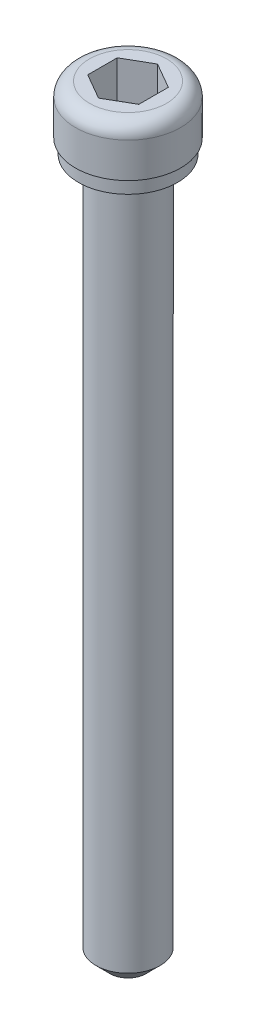
ISO-10303-21;
HEADER;
FILE_DESCRIPTION(('STEP AP214'),'2;1');
FILE_NAME('part.step','',(''),(''),'','','');
FILE_SCHEMA(('AUTOMOTIVE_DESIGN { 1 0 10303 214 1 1 1 1 }'));
ENDSEC;
DATA;
#1=APPLICATION_CONTEXT('core data for automotive mechanical design processes');
#2=APPLICATION_PROTOCOL_DEFINITION('international standard','automotive_design',2000,#1);
#3=PRODUCT_CONTEXT('',#1,'mechanical');
#4=PRODUCT('Part','Part','',(#3));
#5=PRODUCT_RELATED_PRODUCT_CATEGORY('part','',(#4));
#6=PRODUCT_DEFINITION_FORMATION('','',#4);
#7=PRODUCT_DEFINITION_CONTEXT('part definition',#1,'design');
#8=PRODUCT_DEFINITION('design','',#6,#7);
#9=PRODUCT_DEFINITION_SHAPE('','',#8);
#10=(LENGTH_UNIT() NAMED_UNIT(*) SI_UNIT(.MILLI.,.METRE.));
#11=(NAMED_UNIT(*) PLANE_ANGLE_UNIT() SI_UNIT($,.RADIAN.));
#12=(NAMED_UNIT(*) SI_UNIT($,.STERADIAN.) SOLID_ANGLE_UNIT());
#13=UNCERTAINTY_MEASURE_WITH_UNIT(LENGTH_MEASURE(1.E-05),#10,'distance_accuracy_value','');
#14=(GEOMETRIC_REPRESENTATION_CONTEXT(3) GLOBAL_UNCERTAINTY_ASSIGNED_CONTEXT((#13)) GLOBAL_UNIT_ASSIGNED_CONTEXT((#10,
#11,#12)) REPRESENTATION_CONTEXT('',''));
#15=CARTESIAN_POINT('',(0.,0.,0.));
#16=DIRECTION('',(0.,0.,1.));
#17=DIRECTION('',(1.,0.,0.));
#18=AXIS2_PLACEMENT_3D('',#15,#16,#17);
#19=CARTESIAN_POINT('',(-1.3890625,39.497,0.801975608296219));
#20=DIRECTION('',(-0.5,0.,0.866025403784439));
#21=DIRECTION('',(0.866025403784439,0.,0.5));
#22=AXIS2_PLACEMENT_3D('',#19,#20,#21);
#23=PLANE('',#22);
#24=DIRECTION('',(0.866025403784439,0.,0.5));
#25=VECTOR('',#24,1.);
#26=CARTESIAN_POINT('',(-1.3890625,39.497,0.801975608296219));
#27=LINE('',#26,#25);
#28=CARTESIAN_POINT('',(-1.3890625,39.497,0.801975608296219));
#29=VERTEX_POINT('',#28);
#30=CARTESIAN_POINT('',(0.,39.497,1.60395121659243));
#31=VERTEX_POINT('',#30);
#32=EDGE_CURVE('E69',#29,#31,#27,.T.);
#33=ORIENTED_EDGE('',*,*,#32,.F.);
#34=DIRECTION('',(0.,1.,0.));
#35=VECTOR('',#34,1.);
#36=CARTESIAN_POINT('',(-1.3890625,39.497,0.801975608296219));
#37=LINE('',#36,#35);
#38=CARTESIAN_POINT('',(-1.3890625,41.529,0.801975608296219));
#39=VERTEX_POINT('',#38);
#40=EDGE_CURVE('E92',#29,#39,#37,.T.);
#41=ORIENTED_EDGE('',*,*,#40,.T.);
#42=DIRECTION('',(0.866025403784439,0.,0.5));
#43=VECTOR('',#42,1.);
#44=CARTESIAN_POINT('',(-1.3890625,41.529,0.801975608296219));
#45=LINE('',#44,#43);
#46=CARTESIAN_POINT('',(0.,41.529,1.60395121659243));
#47=VERTEX_POINT('',#46);
#48=EDGE_CURVE('E78',#47,#39,#45,.F.);
#49=ORIENTED_EDGE('',*,*,#48,.F.);
#50=DIRECTION('',(0.,1.,0.));
#51=VECTOR('',#50,1.);
#52=CARTESIAN_POINT('',(0.,39.497,1.60395121659243));
#53=LINE('',#52,#51);
#54=EDGE_CURVE('E87',#47,#31,#53,.F.);
#55=ORIENTED_EDGE('',*,*,#54,.T.);
#56=EDGE_LOOP('',(#33,#41,#49,#55));
#57=FACE_BOUND('',#56,.T.);
#58=ADVANCED_FACE('F15',(#57),#23,.F.);
#59=CARTESIAN_POINT('',(0.,39.497,1.60395121659243));
#60=DIRECTION('',(0.5,0.,0.866025403784439));
#61=DIRECTION('',(0.866025403784439,0.,-0.5));
#62=AXIS2_PLACEMENT_3D('',#59,#60,#61);
#63=PLANE('',#62);
#64=DIRECTION('',(0.866025403784439,0.,-0.5));
#65=VECTOR('',#64,1.);
#66=CARTESIAN_POINT('',(0.,39.497,1.60395121659243));
#67=LINE('',#66,#65);
#68=CARTESIAN_POINT('',(1.3890625,39.497,0.80197560829622));
#69=VERTEX_POINT('',#68);
#70=EDGE_CURVE('E96',#31,#69,#67,.T.);
#71=ORIENTED_EDGE('',*,*,#70,.F.);
#72=ORIENTED_EDGE('',*,*,#54,.F.);
#73=DIRECTION('',(0.866025403784439,0.,-0.5));
#74=VECTOR('',#73,1.);
#75=CARTESIAN_POINT('',(0.,41.529,1.60395121659243));
#76=LINE('',#75,#74);
#77=CARTESIAN_POINT('',(1.3890625,41.529,0.80197560829622));
#78=VERTEX_POINT('',#77);
#79=EDGE_CURVE('E74',#78,#47,#76,.F.);
#80=ORIENTED_EDGE('',*,*,#79,.F.);
#81=DIRECTION('',(0.,1.,0.));
#82=VECTOR('',#81,1.);
#83=CARTESIAN_POINT('',(1.3890625,39.497,0.801975608296219));
#84=LINE('',#83,#82);
#85=EDGE_CURVE('E183',#78,#69,#84,.F.);
#86=ORIENTED_EDGE('',*,*,#85,.T.);
#87=EDGE_LOOP('',(#71,#72,#80,#86));
#88=FACE_BOUND('',#87,.T.);
#89=ADVANCED_FACE('F95',(#88),#63,.F.);
#90=CARTESIAN_POINT('',(-1.3890625,39.497,-0.801975608296215));
#91=DIRECTION('',(-1.,0.,0.));
#92=DIRECTION('',(0.,0.,1.));
#93=AXIS2_PLACEMENT_3D('',#90,#91,#92);
#94=PLANE('',#93);
#95=DIRECTION('',(0.,0.,1.));
#96=VECTOR('',#95,1.);
#97=CARTESIAN_POINT('',(-1.3890625,39.497,0.));
#98=LINE('',#97,#96);
#99=CARTESIAN_POINT('',(-1.3890625,39.497,-0.801975608296214));
#100=VERTEX_POINT('',#99);
#101=EDGE_CURVE('E181',#100,#29,#98,.T.);
#102=ORIENTED_EDGE('',*,*,#101,.F.);
#103=DIRECTION('',(0.,1.,0.));
#104=VECTOR('',#103,1.);
#105=CARTESIAN_POINT('',(-1.3890625,39.497,-0.801975608296213));
#106=LINE('',#105,#104);
#107=CARTESIAN_POINT('',(-1.3890625,41.529,-0.801975608296214));
#108=VERTEX_POINT('',#107);
#109=EDGE_CURVE('E169',#100,#108,#106,.T.);
#110=ORIENTED_EDGE('',*,*,#109,.T.);
#111=DIRECTION('',(0.,0.,1.));
#112=VECTOR('',#111,1.);
#113=CARTESIAN_POINT('',(-1.3890625,41.529,-0.801975608296215));
#114=LINE('',#113,#112);
#115=EDGE_CURVE('E98',#39,#108,#114,.F.);
#116=ORIENTED_EDGE('',*,*,#115,.F.);
#117=ORIENTED_EDGE('',*,*,#40,.F.);
#118=EDGE_LOOP('',(#102,#110,#116,#117));
#119=FACE_BOUND('',#118,.T.);
#120=ADVANCED_FACE('F189',(#119),#94,.F.);
#121=CARTESIAN_POINT('',(1.3890625,39.497,0.801975608296219));
#122=DIRECTION('',(1.,0.,0.));
#123=DIRECTION('',(0.,0.,-1.));
#124=AXIS2_PLACEMENT_3D('',#121,#122,#123);
#125=PLANE('',#124);
#126=DIRECTION('',(0.,0.,1.));
#127=VECTOR('',#126,1.);
#128=CARTESIAN_POINT('',(1.3890625,39.497,0.));
#129=LINE('',#128,#127);
#130=CARTESIAN_POINT('',(1.3890625,39.497,-0.801975608296213));
#131=VERTEX_POINT('',#130);
#132=EDGE_CURVE('E178',#69,#131,#129,.F.);
#133=ORIENTED_EDGE('',*,*,#132,.F.);
#134=ORIENTED_EDGE('',*,*,#85,.F.);
#135=DIRECTION('',(0.,0.,-1.));
#136=VECTOR('',#135,1.);
#137=CARTESIAN_POINT('',(1.3890625,41.529,0.801975608296219));
#138=LINE('',#137,#136);
#139=CARTESIAN_POINT('',(1.3890625,41.529,-0.801975608296212));
#140=VERTEX_POINT('',#139);
#141=EDGE_CURVE('E82',#140,#78,#138,.F.);
#142=ORIENTED_EDGE('',*,*,#141,.F.);
#143=DIRECTION('',(0.,1.,0.));
#144=VECTOR('',#143,1.);
#145=CARTESIAN_POINT('',(1.3890625,39.497,-0.801975608296212));
#146=LINE('',#145,#144);
#147=EDGE_CURVE('E167',#140,#131,#146,.F.);
#148=ORIENTED_EDGE('',*,*,#147,.T.);
#149=EDGE_LOOP('',(#133,#134,#142,#148));
#150=FACE_BOUND('',#149,.T.);
#151=ADVANCED_FACE('F200',(#150),#125,.F.);
#152=CARTESIAN_POINT('',(0.,39.497,0.));
#153=DIRECTION('',(0.,1.,0.));
#154=DIRECTION('',(0.,0.,1.));
#155=AXIS2_PLACEMENT_3D('',#152,#153,#154);
#156=PLANE('',#155);
#157=ORIENTED_EDGE('',*,*,#132,.T.);
#158=DIRECTION('',(-0.866025403784439,0.,-0.5));
#159=VECTOR('',#158,1.);
#160=CARTESIAN_POINT('',(1.3890625,39.497,-0.801975608296212));
#161=LINE('',#160,#159);
#162=CARTESIAN_POINT('',(0.,39.497,-1.60395121659243));
#163=VERTEX_POINT('',#162);
#164=EDGE_CURVE('E165',#131,#163,#161,.T.);
#165=ORIENTED_EDGE('',*,*,#164,.T.);
#166=DIRECTION('',(-0.866025403784439,0.,0.5));
#167=VECTOR('',#166,1.);
#168=CARTESIAN_POINT('',(0.,39.497,-1.60395121659243));
#169=LINE('',#168,#167);
#170=EDGE_CURVE('E172',#163,#100,#169,.T.);
#171=ORIENTED_EDGE('',*,*,#170,.T.);
#172=ORIENTED_EDGE('',*,*,#101,.T.);
#173=ORIENTED_EDGE('',*,*,#32,.T.);
#174=ORIENTED_EDGE('',*,*,#70,.T.);
#175=EDGE_LOOP('',(#157,#165,#171,#172,#173,#174));
#176=FACE_BOUND('',#175,.T.);
#177=ADVANCED_FACE('F201',(#176),#156,.T.);
#178=CARTESIAN_POINT('',(0.,39.497,-1.60395121659243));
#179=DIRECTION('',(-0.5,0.,-0.866025403784439));
#180=DIRECTION('',(-0.866025403784439,0.,0.5));
#181=AXIS2_PLACEMENT_3D('',#178,#179,#180);
#182=PLANE('',#181);
#183=ORIENTED_EDGE('',*,*,#170,.F.);
#184=DIRECTION('',(0.,1.,0.));
#185=VECTOR('',#184,1.);
#186=CARTESIAN_POINT('',(0.,39.497,-1.60395121659243));
#187=LINE('',#186,#185);
#188=CARTESIAN_POINT('',(0.,41.529,-1.60395121659243));
#189=VERTEX_POINT('',#188);
#190=EDGE_CURVE('E162',#163,#189,#187,.T.);
#191=ORIENTED_EDGE('',*,*,#190,.T.);
#192=DIRECTION('',(-0.866025403784439,0.,0.5));
#193=VECTOR('',#192,1.);
#194=CARTESIAN_POINT('',(0.,41.529,-1.60395121659243));
#195=LINE('',#194,#193);
#196=EDGE_CURVE('E175',#108,#189,#195,.F.);
#197=ORIENTED_EDGE('',*,*,#196,.F.);
#198=ORIENTED_EDGE('',*,*,#109,.F.);
#199=EDGE_LOOP('',(#183,#191,#197,#198));
#200=FACE_BOUND('',#199,.T.);
#201=ADVANCED_FACE('F192',(#200),#182,.F.);
#202=CARTESIAN_POINT('',(1.3890625,39.497,-0.801975608296212));
#203=DIRECTION('',(0.5,0.,-0.866025403784439));
#204=DIRECTION('',(-0.866025403784439,0.,-0.5));
#205=AXIS2_PLACEMENT_3D('',#202,#203,#204);
#206=PLANE('',#205);
#207=ORIENTED_EDGE('',*,*,#164,.F.);
#208=ORIENTED_EDGE('',*,*,#147,.F.);
#209=DIRECTION('',(-0.866025403784439,0.,-0.5));
#210=VECTOR('',#209,1.);
#211=CARTESIAN_POINT('',(1.3890625,41.529,-0.801975608296214));
#212=LINE('',#211,#210);
#213=EDGE_CURVE('E154',#140,#189,#212,.T.);
#214=ORIENTED_EDGE('',*,*,#213,.T.);
#215=ORIENTED_EDGE('',*,*,#190,.F.);
#216=EDGE_LOOP('',(#207,#208,#214,#215));
#217=FACE_BOUND('',#216,.T.);
#218=ADVANCED_FACE('F197',(#217),#206,.F.);
#219=CARTESIAN_POINT('',(-2.0955,41.529,0.));
#220=DIRECTION('',(0.,-1.,0.));
#221=DIRECTION('',(0.,0.,-1.));
#222=AXIS2_PLACEMENT_3D('',#219,#220,#221);
#223=PLANE('',#222);
#224=ORIENTED_EDGE('',*,*,#141,.T.);
#225=ORIENTED_EDGE('',*,*,#79,.T.);
#226=ORIENTED_EDGE('',*,*,#48,.T.);
#227=ORIENTED_EDGE('',*,*,#115,.T.);
#228=ORIENTED_EDGE('',*,*,#196,.T.);
#229=ORIENTED_EDGE('',*,*,#213,.F.);
#230=EDGE_LOOP('',(#224,#225,#226,#227,#228,#229));
#231=FACE_BOUND('',#230,.T.);
#232=CARTESIAN_POINT('',(0.,41.529,0.));
#233=DIRECTION('',(0.,-1.,0.));
#234=DIRECTION('',(0.,0.,1.));
#235=AXIS2_PLACEMENT_3D('',#232,#233,#234);
#236=CIRCLE('',#235,2.0955);
#237=CARTESIAN_POINT('',(0.,41.529,2.0955));
#238=VERTEX_POINT('',#237);
#239=CARTESIAN_POINT('',(0.,41.529,-2.0955));
#240=VERTEX_POINT('',#239);
#241=EDGE_CURVE('E119',#238,#240,#236,.T.);
#242=ORIENTED_EDGE('',*,*,#241,.F.);
#243=CARTESIAN_POINT('',(0.,41.529,0.));
#244=DIRECTION('',(0.,-1.,0.));
#245=DIRECTION('',(0.,0.,-1.));
#246=AXIS2_PLACEMENT_3D('',#243,#244,#245);
#247=CIRCLE('',#246,2.0955);
#248=EDGE_CURVE('E34',#240,#238,#247,.T.);
#249=ORIENTED_EDGE('',*,*,#248,.F.);
#250=EDGE_LOOP('',(#242,#249));
#251=FACE_BOUND('',#250,.T.);
#252=ADVANCED_FACE('F76',(#231,#251),#223,.F.);
#253=CARTESIAN_POINT('',(0.,40.767,0.));
#254=DIRECTION('',(0.,-1.,0.));
#255=DIRECTION('',(0.,0.,-1.));
#256=AXIS2_PLACEMENT_3D('',#253,#254,#255);
#257=TOROIDAL_SURFACE('',#256,2.0955,0.761999999999999);
#258=ORIENTED_EDGE('',*,*,#248,.T.);
#259=ORIENTED_EDGE('',*,*,#241,.T.);
#260=EDGE_LOOP('',(#258,#259));
#261=FACE_BOUND('',#260,.T.);
#262=CARTESIAN_POINT('',(0.,40.767,0.));
#263=DIRECTION('',(0.,-1.,0.));
#264=DIRECTION('',(0.,0.,-1.));
#265=AXIS2_PLACEMENT_3D('',#262,#263,#264);
#266=CIRCLE('',#265,2.8575);
#267=CARTESIAN_POINT('',(0.,40.767,-2.8575));
#268=VERTEX_POINT('',#267);
#269=EDGE_CURVE('E117',#268,#268,#266,.T.);
#270=ORIENTED_EDGE('',*,*,#269,.F.);
#271=EDGE_LOOP('',(#270));
#272=FACE_BOUND('',#271,.T.);
#273=ADVANCED_FACE('F122',(#261,#272),#257,.T.);
#274=CARTESIAN_POINT('',(0.,0.,0.));
#275=DIRECTION('',(0.,-1.,0.));
#276=DIRECTION('',(0.,0.,-1.));
#277=AXIS2_PLACEMENT_3D('',#274,#275,#276);
#278=CYLINDRICAL_SURFACE('',#277,2.8575);
#279=ORIENTED_EDGE('',*,*,#269,.T.);
#280=EDGE_LOOP('',(#279));
#281=FACE_BOUND('',#280,.T.);
#282=CARTESIAN_POINT('',(0.,38.862,0.));
#283=DIRECTION('',(0.,-1.,0.));
#284=DIRECTION('',(0.,0.,-1.));
#285=AXIS2_PLACEMENT_3D('',#282,#283,#284);
#286=CIRCLE('',#285,2.8575);
#287=CARTESIAN_POINT('',(0.,38.862,-2.8575));
#288=VERTEX_POINT('',#287);
#289=EDGE_CURVE('E114',#288,#288,#286,.F.);
#290=ORIENTED_EDGE('',*,*,#289,.T.);
#291=EDGE_LOOP('',(#290));
#292=FACE_BOUND('',#291,.T.);
#293=ADVANCED_FACE('F133',(#281,#292),#278,.T.);
#294=CARTESIAN_POINT('',(-2.8575,38.862,0.));
#295=DIRECTION('',(0.,1.,0.));
#296=DIRECTION('',(0.,0.,1.));
#297=AXIS2_PLACEMENT_3D('',#294,#295,#296);
#298=PLANE('',#297);
#299=CARTESIAN_POINT('',(0.,38.862,0.));
#300=DIRECTION('',(0.,-1.,0.));
#301=DIRECTION('',(0.,0.,-1.));
#302=AXIS2_PLACEMENT_3D('',#299,#300,#301);
#303=CIRCLE('',#302,2.6924);
#304=CARTESIAN_POINT('',(0.,38.862,-2.6924));
#305=VERTEX_POINT('',#304);
#306=EDGE_CURVE('E111',#305,#305,#303,.T.);
#307=ORIENTED_EDGE('',*,*,#306,.F.);
#308=EDGE_LOOP('',(#307));
#309=FACE_BOUND('',#308,.T.);
#310=ORIENTED_EDGE('',*,*,#289,.F.);
#311=EDGE_LOOP('',(#310));
#312=FACE_BOUND('',#311,.T.);
#313=ADVANCED_FACE('F233',(#309,#312),#298,.F.);
#314=CARTESIAN_POINT('',(0.,0.,0.));
#315=DIRECTION('',(0.,-1.,0.));
#316=DIRECTION('',(0.,0.,-1.));
#317=AXIS2_PLACEMENT_3D('',#314,#315,#316);
#318=CYLINDRICAL_SURFACE('',#317,2.6924);
#319=ORIENTED_EDGE('',*,*,#306,.T.);
#320=EDGE_LOOP('',(#319));
#321=FACE_BOUND('',#320,.T.);
#322=CARTESIAN_POINT('',(0.,38.1,0.));
#323=DIRECTION('',(0.,-1.,0.));
#324=DIRECTION('',(0.,0.,-1.));
#325=AXIS2_PLACEMENT_3D('',#322,#323,#324);
#326=CIRCLE('',#325,2.6924);
#327=CARTESIAN_POINT('',(0.,38.1,-2.6924));
#328=VERTEX_POINT('',#327);
#329=EDGE_CURVE('E108',#328,#328,#326,.F.);
#330=ORIENTED_EDGE('',*,*,#329,.T.);
#331=EDGE_LOOP('',(#330));
#332=FACE_BOUND('',#331,.T.);
#333=ADVANCED_FACE('F230',(#321,#332),#318,.T.);
#334=CARTESIAN_POINT('',(0.,0.,0.));
#335=DIRECTION('',(0.,1.,0.));
#336=DIRECTION('',(0.,0.,1.));
#337=AXIS2_PLACEMENT_3D('',#334,#335,#336);
#338=PLANE('',#337);
#339=CARTESIAN_POINT('',(0.,-5.6843418860808E-11,0.));
#340=DIRECTION('',(0.,1.,0.));
#341=DIRECTION('',(0.,0.,1.));
#342=AXIS2_PLACEMENT_3D('',#339,#340,#341);
#343=CIRCLE('',#342,0.977899999952569);
#344=CARTESIAN_POINT('',(0.,-5.6843418860808E-11,0.977899999952569));
#345=VERTEX_POINT('',#344);
#346=EDGE_CURVE('E105',#345,#345,#343,.T.);
#347=ORIENTED_EDGE('',*,*,#346,.F.);
#348=EDGE_LOOP('',(#347));
#349=FACE_BOUND('',#348,.T.);
#350=ADVANCED_FACE('F226',(#349),#338,.F.);
#351=CARTESIAN_POINT('',(-1.7399,38.1,0.));
#352=DIRECTION('',(0.,1.,0.));
#353=DIRECTION('',(0.,0.,1.));
#354=AXIS2_PLACEMENT_3D('',#351,#352,#353);
#355=PLANE('',#354);
#356=CARTESIAN_POINT('',(0.,38.1,0.));
#357=DIRECTION('',(0.,-1.,0.));
#358=DIRECTION('',(0.,0.,-1.));
#359=AXIS2_PLACEMENT_3D('',#356,#357,#358);
#360=CIRCLE('',#359,1.7399);
#361=CARTESIAN_POINT('',(0.,38.1,-1.7399));
#362=VERTEX_POINT('',#361);
#363=EDGE_CURVE('E26',#362,#362,#360,.T.);
#364=ORIENTED_EDGE('',*,*,#363,.F.);
#365=EDGE_LOOP('',(#364));
#366=FACE_BOUND('',#365,.T.);
#367=ORIENTED_EDGE('',*,*,#329,.F.);
#368=EDGE_LOOP('',(#367));
#369=FACE_BOUND('',#368,.T.);
#370=ADVANCED_FACE('F219',(#366,#369),#355,.F.);
#371=CARTESIAN_POINT('',(0.,0.762000000008811,0.));
#372=DIRECTION('',(0.,1.,0.));
#373=DIRECTION('',(0.,0.,1.));
#374=AXIS2_PLACEMENT_3D('',#371,#372,#373);
#375=CONICAL_SURFACE('',#374,1.73990000001822,0.785398163397448);
#376=CARTESIAN_POINT('',(0.,0.761999999999999,0.));
#377=DIRECTION('',(0.,-1.,0.));
#378=DIRECTION('',(0.,0.,-1.));
#379=AXIS2_PLACEMENT_3D('',#376,#377,#378);
#380=CIRCLE('',#379,1.7399);
#381=CARTESIAN_POINT('',(0.,0.761999999999999,-1.7399));
#382=VERTEX_POINT('',#381);
#383=EDGE_CURVE('E10',#382,#382,#380,.F.);
#384=ORIENTED_EDGE('',*,*,#383,.F.);
#385=EDGE_LOOP('',(#384));
#386=FACE_BOUND('',#385,.T.);
#387=ORIENTED_EDGE('',*,*,#346,.T.);
#388=EDGE_LOOP('',(#387));
#389=FACE_BOUND('',#388,.T.);
#390=ADVANCED_FACE('F213',(#386,#389),#375,.T.);
#391=CARTESIAN_POINT('',(0.,0.,0.));
#392=DIRECTION('',(0.,-1.,0.));
#393=DIRECTION('',(0.,0.,-1.));
#394=AXIS2_PLACEMENT_3D('',#391,#392,#393);
#395=CYLINDRICAL_SURFACE('',#394,1.7399);
#396=ORIENTED_EDGE('',*,*,#363,.T.);
#397=EDGE_LOOP('',(#396));
#398=FACE_BOUND('',#397,.T.);
#399=ORIENTED_EDGE('',*,*,#383,.T.);
#400=EDGE_LOOP('',(#399));
#401=FACE_BOUND('',#400,.T.);
#402=ADVANCED_FACE('F211',(#398,#401),#395,.T.);
#403=CLOSED_SHELL('',(#58,#89,#120,#151,#177,#201,#218,#252,#273,#293,#313,#333,#350,#370,#390,#402));
#404=MANIFOLD_SOLID_BREP('B1',#403);
#405=ADVANCED_BREP_SHAPE_REPRESENTATION('',(#18,#404),#14);
#406=SHAPE_DEFINITION_REPRESENTATION(#9,#405);
ENDSEC;
END-ISO-10303-21;
